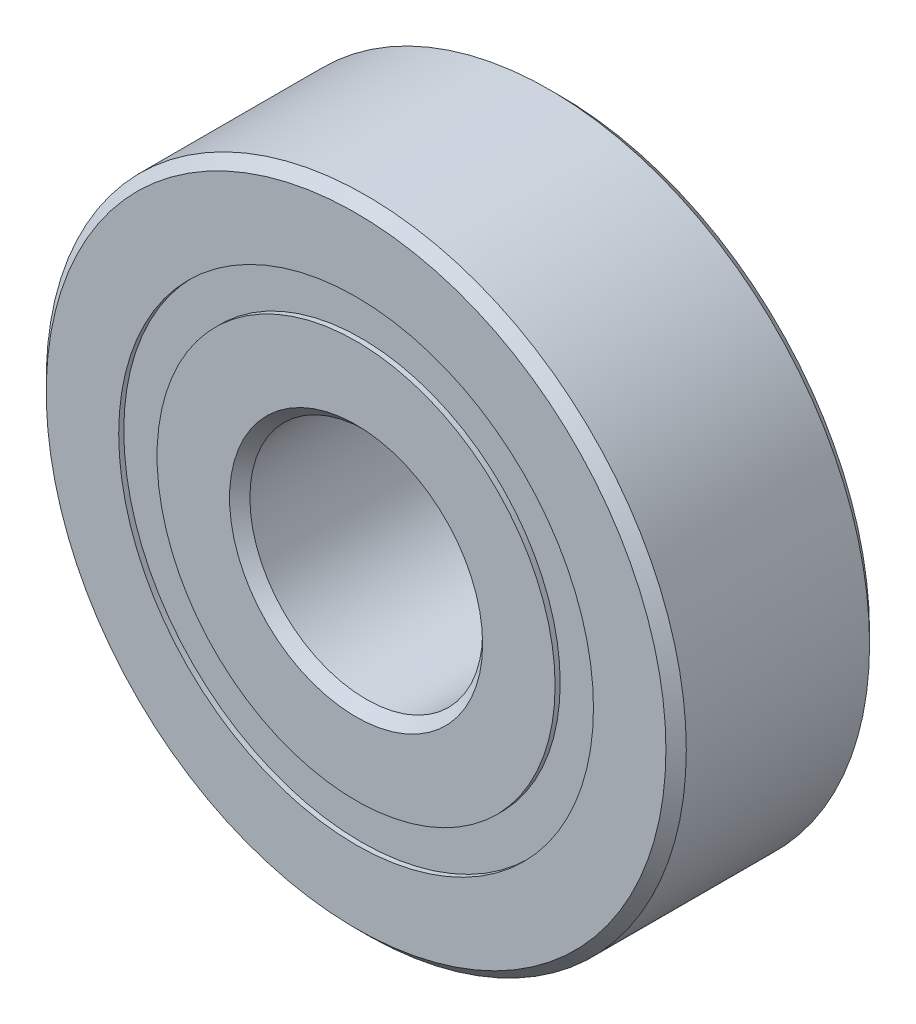
ISO-10303-21;
HEADER;
FILE_DESCRIPTION(('STEP AP214'),'2;1');
FILE_NAME('part.step','',(''),(''),'','','');
FILE_SCHEMA(('AUTOMOTIVE_DESIGN { 1 0 10303 214 1 1 1 1 }'));
ENDSEC;
DATA;
#1=APPLICATION_CONTEXT('core data for automotive mechanical design processes');
#2=APPLICATION_PROTOCOL_DEFINITION('international standard','automotive_design',2000,#1);
#3=PRODUCT_CONTEXT('',#1,'mechanical');
#4=PRODUCT('Part','Part','',(#3));
#5=PRODUCT_RELATED_PRODUCT_CATEGORY('part','',(#4));
#6=PRODUCT_DEFINITION_FORMATION('','',#4);
#7=PRODUCT_DEFINITION_CONTEXT('part definition',#1,'design');
#8=PRODUCT_DEFINITION('design','',#6,#7);
#9=PRODUCT_DEFINITION_SHAPE('','',#8);
#10=(LENGTH_UNIT() NAMED_UNIT(*) SI_UNIT(.MILLI.,.METRE.));
#11=(NAMED_UNIT(*) PLANE_ANGLE_UNIT() SI_UNIT($,.RADIAN.));
#12=(NAMED_UNIT(*) SI_UNIT($,.STERADIAN.) SOLID_ANGLE_UNIT());
#13=UNCERTAINTY_MEASURE_WITH_UNIT(LENGTH_MEASURE(1.E-05),#10,'distance_accuracy_value','');
#14=(GEOMETRIC_REPRESENTATION_CONTEXT(3) GLOBAL_UNCERTAINTY_ASSIGNED_CONTEXT((#13)) GLOBAL_UNIT_ASSIGNED_CONTEXT((#10,
#11,#12)) REPRESENTATION_CONTEXT('',''));
#15=CARTESIAN_POINT('',(0.,0.,0.));
#16=DIRECTION('',(0.,0.,1.));
#17=DIRECTION('',(1.,0.,0.));
#18=AXIS2_PLACEMENT_3D('',#15,#16,#17);
#19=CARTESIAN_POINT('',(0.,8.15934065934066,-3.325));
#20=DIRECTION('',(0.,0.,1.));
#21=DIRECTION('',(1.,0.,0.));
#22=AXIS2_PLACEMENT_3D('',#19,#20,#21);
#23=PLANE('',#22);
#24=CARTESIAN_POINT('',(0.,0.,-3.325));
#25=DIRECTION('',(0.,0.,1.));
#26=DIRECTION('',(1.,0.,0.));
#27=AXIS2_PLACEMENT_3D('',#24,#25,#26);
#28=CIRCLE('',#27,8.15934065934066);
#29=CARTESIAN_POINT('',(8.15934065934066,0.,-3.325));
#30=VERTEX_POINT('',#29);
#31=EDGE_CURVE('E55',#30,#30,#28,.T.);
#32=ORIENTED_EDGE('',*,*,#31,.F.);
#33=EDGE_LOOP('',(#32));
#34=FACE_BOUND('',#33,.T.);
#35=CARTESIAN_POINT('',(0.,0.,-3.325));
#36=DIRECTION('',(0.,0.,1.));
#37=DIRECTION('',(1.,0.,0.));
#38=AXIS2_PLACEMENT_3D('',#35,#36,#37);
#39=CIRCLE('',#38,6.84065934065934);
#40=CARTESIAN_POINT('',(6.84065934065934,0.,-3.325));
#41=VERTEX_POINT('',#40);
#42=EDGE_CURVE('E11',#41,#41,#39,.T.);
#43=ORIENTED_EDGE('',*,*,#42,.T.);
#44=EDGE_LOOP('',(#43));
#45=FACE_BOUND('',#44,.T.);
#46=ADVANCED_FACE('F41',(#34,#45),#23,.F.);
#47=CARTESIAN_POINT('',(0.,0.,3.5));
#48=DIRECTION('',(0.,0.,1.));
#49=DIRECTION('',(1.,0.,0.));
#50=AXIS2_PLACEMENT_3D('',#47,#48,#49);
#51=CYLINDRICAL_SURFACE('',#50,6.84065934065934);
#52=ORIENTED_EDGE('',*,*,#42,.F.);
#53=EDGE_LOOP('',(#52));
#54=FACE_BOUND('',#53,.T.);
#55=CARTESIAN_POINT('',(0.,0.,-1.68952158656808));
#56=DIRECTION('',(0.,0.,1.));
#57=DIRECTION('',(1.,0.,0.));
#58=AXIS2_PLACEMENT_3D('',#55,#56,#57);
#59=CIRCLE('',#58,6.84065934065934);
#60=CARTESIAN_POINT('',(6.84065934065934,0.,-1.68952158656808));
#61=VERTEX_POINT('',#60);
#62=EDGE_CURVE('E47',#61,#61,#59,.T.);
#63=ORIENTED_EDGE('',*,*,#62,.T.);
#64=EDGE_LOOP('',(#63));
#65=FACE_BOUND('',#64,.T.);
#66=ADVANCED_FACE('F64',(#54,#65),#51,.F.);
#67=CARTESIAN_POINT('',(0.,8.15934065934066,-1.68952158656808));
#68=DIRECTION('',(0.,0.,-1.));
#69=DIRECTION('',(-1.,0.,0.));
#70=AXIS2_PLACEMENT_3D('',#67,#68,#69);
#71=PLANE('',#70);
#72=ORIENTED_EDGE('',*,*,#62,.F.);
#73=EDGE_LOOP('',(#72));
#74=FACE_BOUND('',#73,.T.);
#75=CARTESIAN_POINT('',(0.,0.,-1.68952158656808));
#76=DIRECTION('',(0.,0.,1.));
#77=DIRECTION('',(1.,0.,0.));
#78=AXIS2_PLACEMENT_3D('',#75,#76,#77);
#79=CIRCLE('',#78,8.15934065934066);
#80=CARTESIAN_POINT('',(8.15934065934066,0.,-1.68952158656808));
#81=VERTEX_POINT('',#80);
#82=EDGE_CURVE('E51',#81,#81,#79,.T.);
#83=ORIENTED_EDGE('',*,*,#82,.T.);
#84=EDGE_LOOP('',(#83));
#85=FACE_BOUND('',#84,.T.);
#86=ADVANCED_FACE('F68',(#74,#85),#71,.F.);
#87=CARTESIAN_POINT('',(0.,0.,3.5));
#88=DIRECTION('',(0.,0.,1.));
#89=DIRECTION('',(1.,0.,0.));
#90=AXIS2_PLACEMENT_3D('',#87,#88,#89);
#91=CYLINDRICAL_SURFACE('',#90,8.15934065934066);
#92=ORIENTED_EDGE('',*,*,#82,.F.);
#93=EDGE_LOOP('',(#92));
#94=FACE_BOUND('',#93,.T.);
#95=ORIENTED_EDGE('',*,*,#31,.T.);
#96=EDGE_LOOP('',(#95));
#97=FACE_BOUND('',#96,.T.);
#98=ADVANCED_FACE('F61',(#94,#97),#91,.T.);
#99=CLOSED_SHELL('',(#46,#66,#86,#98));
#100=MANIFOLD_SOLID_BREP('B2',#99);
#101=CARTESIAN_POINT('',(0.,8.15934065934066,3.325));
#102=DIRECTION('',(0.,0.,-1.));
#103=DIRECTION('',(-1.,0.,0.));
#104=AXIS2_PLACEMENT_3D('',#101,#102,#103);
#105=PLANE('',#104);
#106=CARTESIAN_POINT('',(0.,0.,3.325));
#107=DIRECTION('',(0.,0.,1.));
#108=DIRECTION('',(1.,0.,0.));
#109=AXIS2_PLACEMENT_3D('',#106,#107,#108);
#110=CIRCLE('',#109,6.84065934065934);
#111=CARTESIAN_POINT('',(6.84065934065934,0.,3.325));
#112=VERTEX_POINT('',#111);
#113=EDGE_CURVE('E40',#112,#112,#110,.T.);
#114=ORIENTED_EDGE('',*,*,#113,.F.);
#115=EDGE_LOOP('',(#114));
#116=FACE_BOUND('',#115,.T.);
#117=CARTESIAN_POINT('',(0.,0.,3.325));
#118=DIRECTION('',(0.,0.,1.));
#119=DIRECTION('',(1.,0.,0.));
#120=AXIS2_PLACEMENT_3D('',#117,#118,#119);
#121=CIRCLE('',#120,8.15934065934066);
#122=CARTESIAN_POINT('',(8.15934065934066,0.,3.325));
#123=VERTEX_POINT('',#122);
#124=EDGE_CURVE('E122',#123,#123,#121,.T.);
#125=ORIENTED_EDGE('',*,*,#124,.T.);
#126=EDGE_LOOP('',(#125));
#127=FACE_BOUND('',#126,.T.);
#128=ADVANCED_FACE('F108',(#116,#127),#105,.F.);
#129=CARTESIAN_POINT('',(0.,0.,3.5));
#130=DIRECTION('',(0.,0.,1.));
#131=DIRECTION('',(1.,0.,0.));
#132=AXIS2_PLACEMENT_3D('',#129,#130,#131);
#133=CYLINDRICAL_SURFACE('',#132,6.84065934065934);
#134=CARTESIAN_POINT('',(0.,0.,1.68952158656808));
#135=DIRECTION('',(0.,0.,1.));
#136=DIRECTION('',(1.,0.,0.));
#137=AXIS2_PLACEMENT_3D('',#134,#135,#136);
#138=CIRCLE('',#137,6.84065934065934);
#139=CARTESIAN_POINT('',(6.84065934065934,0.,1.68952158656808));
#140=VERTEX_POINT('',#139);
#141=EDGE_CURVE('E114',#140,#140,#138,.T.);
#142=ORIENTED_EDGE('',*,*,#141,.F.);
#143=EDGE_LOOP('',(#142));
#144=FACE_BOUND('',#143,.T.);
#145=ORIENTED_EDGE('',*,*,#113,.T.);
#146=EDGE_LOOP('',(#145));
#147=FACE_BOUND('',#146,.T.);
#148=ADVANCED_FACE('F137',(#144,#147),#133,.F.);
#149=CARTESIAN_POINT('',(0.,8.15934065934066,1.68952158656808));
#150=DIRECTION('',(0.,0.,1.));
#151=DIRECTION('',(1.,0.,0.));
#152=AXIS2_PLACEMENT_3D('',#149,#150,#151);
#153=PLANE('',#152);
#154=CARTESIAN_POINT('',(0.,0.,1.68952158656808));
#155=DIRECTION('',(0.,0.,1.));
#156=DIRECTION('',(1.,0.,0.));
#157=AXIS2_PLACEMENT_3D('',#154,#155,#156);
#158=CIRCLE('',#157,8.15934065934066);
#159=CARTESIAN_POINT('',(8.15934065934066,0.,1.68952158656808));
#160=VERTEX_POINT('',#159);
#161=EDGE_CURVE('E118',#160,#160,#158,.T.);
#162=ORIENTED_EDGE('',*,*,#161,.F.);
#163=EDGE_LOOP('',(#162));
#164=FACE_BOUND('',#163,.T.);
#165=ORIENTED_EDGE('',*,*,#141,.T.);
#166=EDGE_LOOP('',(#165));
#167=FACE_BOUND('',#166,.T.);
#168=ADVANCED_FACE('F132',(#164,#167),#153,.F.);
#169=CARTESIAN_POINT('',(0.,0.,3.5));
#170=DIRECTION('',(0.,0.,1.));
#171=DIRECTION('',(1.,0.,0.));
#172=AXIS2_PLACEMENT_3D('',#169,#170,#171);
#173=CYLINDRICAL_SURFACE('',#172,8.15934065934066);
#174=ORIENTED_EDGE('',*,*,#124,.F.);
#175=EDGE_LOOP('',(#174));
#176=FACE_BOUND('',#175,.T.);
#177=ORIENTED_EDGE('',*,*,#161,.T.);
#178=EDGE_LOOP('',(#177));
#179=FACE_BOUND('',#178,.T.);
#180=ADVANCED_FACE('F129',(#176,#179),#173,.T.);
#181=CLOSED_SHELL('',(#128,#148,#168,#180));
#182=MANIFOLD_SOLID_BREP('B6',#181);
#183=CARTESIAN_POINT('',(-3.74999999999992,6.49519052838334,0.));
#184=DIRECTION('',(0.,0.,1.));
#185=DIRECTION('',(-0.499999999999989,0.866025403784445,0.));
#186=AXIS2_PLACEMENT_3D('',#183,#184,#185);
#187=SPHERICAL_SURFACE('',#186,1.68952158656808);
#188=CARTESIAN_POINT('',(-3.74999999999992,6.49519052838334,1.68952158656808));
#189=VERTEX_POINT('',#188);
#190=VERTEX_LOOP('',#189);
#191=FACE_BOUND('',#190,.T.);
#192=ADVANCED_FACE('F175',(#191),#187,.T.);
#193=CLOSED_SHELL('',(#192));
#194=MANIFOLD_SOLID_BREP('B35',#193);
#195=CARTESIAN_POINT('',(-6.49519052838325,3.75000000000008,0.));
#196=DIRECTION('',(0.,0.,1.));
#197=DIRECTION('',(-0.866025403784433,0.50000000000001,0.));
#198=AXIS2_PLACEMENT_3D('',#195,#196,#197);
#199=SPHERICAL_SURFACE('',#198,1.68952158656808);
#200=CARTESIAN_POINT('',(-6.49519052838325,3.75000000000008,1.68952158656808));
#201=VERTEX_POINT('',#200);
#202=VERTEX_LOOP('',#201);
#203=FACE_BOUND('',#202,.T.);
#204=ADVANCED_FACE('F195',(#203),#199,.T.);
#205=CLOSED_SHELL('',(#204));
#206=MANIFOLD_SOLID_BREP('B104',#205);
#207=CARTESIAN_POINT('',(-7.5,0.,0.));
#208=DIRECTION('',(0.,0.,1.));
#209=DIRECTION('',(-1.,0.,0.));
#210=AXIS2_PLACEMENT_3D('',#207,#208,#209);
#211=SPHERICAL_SURFACE('',#210,1.68952158656808);
#212=CARTESIAN_POINT('',(-7.5,0.,1.68952158656808));
#213=VERTEX_POINT('',#212);
#214=VERTEX_LOOP('',#213);
#215=FACE_BOUND('',#214,.T.);
#216=ADVANCED_FACE('F215',(#215),#211,.T.);
#217=CLOSED_SHELL('',(#216));
#218=MANIFOLD_SOLID_BREP('B171',#217);
#219=CARTESIAN_POINT('',(-6.49519052838332,-3.74999999999994,0.));
#220=DIRECTION('',(0.,0.,1.));
#221=DIRECTION('',(-0.866025403784443,-0.499999999999992,0.));
#222=AXIS2_PLACEMENT_3D('',#219,#220,#221);
#223=SPHERICAL_SURFACE('',#222,1.68952158656808);
#224=CARTESIAN_POINT('',(-6.49519052838332,-3.74999999999994,1.68952158656808));
#225=VERTEX_POINT('',#224);
#226=VERTEX_LOOP('',#225);
#227=FACE_BOUND('',#226,.T.);
#228=ADVANCED_FACE('F235',(#227),#223,.T.);
#229=CLOSED_SHELL('',(#228));
#230=MANIFOLD_SOLID_BREP('B191',#229);
#231=CARTESIAN_POINT('',(-3.75000000000005,-6.49519052838326,0.));
#232=DIRECTION('',(0.,0.,1.));
#233=DIRECTION('',(-0.500000000000007,-0.866025403784435,0.));
#234=AXIS2_PLACEMENT_3D('',#231,#232,#233);
#235=SPHERICAL_SURFACE('',#234,1.68952158656808);
#236=CARTESIAN_POINT('',(-3.75000000000005,-6.49519052838326,1.68952158656808));
#237=VERTEX_POINT('',#236);
#238=VERTEX_LOOP('',#237);
#239=FACE_BOUND('',#238,.T.);
#240=ADVANCED_FACE('F255',(#239),#235,.T.);
#241=CLOSED_SHELL('',(#240));
#242=MANIFOLD_SOLID_BREP('B211',#241);
#243=CARTESIAN_POINT('',(0.,-7.5,0.));
#244=DIRECTION('',(0.,0.,1.));
#245=DIRECTION('',(0.,-1.,0.));
#246=AXIS2_PLACEMENT_3D('',#243,#244,#245);
#247=SPHERICAL_SURFACE('',#246,1.68952158656808);
#248=CARTESIAN_POINT('',(0.,-7.5,1.68952158656808));
#249=VERTEX_POINT('',#248);
#250=VERTEX_LOOP('',#249);
#251=FACE_BOUND('',#250,.T.);
#252=ADVANCED_FACE('F275',(#251),#247,.T.);
#253=CLOSED_SHELL('',(#252));
#254=MANIFOLD_SOLID_BREP('B231',#253);
#255=CARTESIAN_POINT('',(3.74999999999996,-6.49519052838331,0.));
#256=DIRECTION('',(0.,0.,1.));
#257=DIRECTION('',(0.499999999999995,-0.866025403784442,0.));
#258=AXIS2_PLACEMENT_3D('',#255,#256,#257);
#259=SPHERICAL_SURFACE('',#258,1.68952158656808);
#260=CARTESIAN_POINT('',(3.74999999999996,-6.49519052838331,1.68952158656808));
#261=VERTEX_POINT('',#260);
#262=VERTEX_LOOP('',#261);
#263=FACE_BOUND('',#262,.T.);
#264=ADVANCED_FACE('F295',(#263),#259,.T.);
#265=CLOSED_SHELL('',(#264));
#266=MANIFOLD_SOLID_BREP('B251',#265);
#267=CARTESIAN_POINT('',(6.49519052838327,-3.75000000000003,0.));
#268=DIRECTION('',(0.,0.,1.));
#269=DIRECTION('',(0.866025403784436,-0.500000000000004,0.));
#270=AXIS2_PLACEMENT_3D('',#267,#268,#269);
#271=SPHERICAL_SURFACE('',#270,1.68952158656808);
#272=CARTESIAN_POINT('',(6.49519052838327,-3.75000000000003,1.68952158656808));
#273=VERTEX_POINT('',#272);
#274=VERTEX_LOOP('',#273);
#275=FACE_BOUND('',#274,.T.);
#276=ADVANCED_FACE('F315',(#275),#271,.T.);
#277=CLOSED_SHELL('',(#276));
#278=MANIFOLD_SOLID_BREP('B271',#277);
#279=CARTESIAN_POINT('',(7.5,0.,0.));
#280=DIRECTION('',(0.,0.,1.));
#281=DIRECTION('',(1.,0.,0.));
#282=AXIS2_PLACEMENT_3D('',#279,#280,#281);
#283=SPHERICAL_SURFACE('',#282,1.68952158656808);
#284=CARTESIAN_POINT('',(7.5,0.,1.68952158656808));
#285=VERTEX_POINT('',#284);
#286=VERTEX_LOOP('',#285);
#287=FACE_BOUND('',#286,.T.);
#288=ADVANCED_FACE('F335',(#287),#283,.T.);
#289=CLOSED_SHELL('',(#288));
#290=MANIFOLD_SOLID_BREP('B291',#289);
#291=CARTESIAN_POINT('',(6.4951905283833,3.74999999999998,0.));
#292=DIRECTION('',(0.,0.,1.));
#293=DIRECTION('',(0.86602540378444,0.499999999999998,0.));
#294=AXIS2_PLACEMENT_3D('',#291,#292,#293);
#295=SPHERICAL_SURFACE('',#294,1.68952158656808);
#296=CARTESIAN_POINT('',(6.4951905283833,3.74999999999998,1.68952158656808));
#297=VERTEX_POINT('',#296);
#298=VERTEX_LOOP('',#297);
#299=FACE_BOUND('',#298,.T.);
#300=ADVANCED_FACE('F355',(#299),#295,.T.);
#301=CLOSED_SHELL('',(#300));
#302=MANIFOLD_SOLID_BREP('B311',#301);
#303=CARTESIAN_POINT('',(3.75000000000001,6.49519052838328,0.));
#304=DIRECTION('',(0.,0.,1.));
#305=DIRECTION('',(0.500000000000001,0.866025403784438,0.));
#306=AXIS2_PLACEMENT_3D('',#303,#304,#305);
#307=SPHERICAL_SURFACE('',#306,1.68952158656808);
#308=CARTESIAN_POINT('',(3.75000000000001,6.49519052838328,1.68952158656808));
#309=VERTEX_POINT('',#308);
#310=VERTEX_LOOP('',#309);
#311=FACE_BOUND('',#310,.T.);
#312=ADVANCED_FACE('F375',(#311),#307,.T.);
#313=CLOSED_SHELL('',(#312));
#314=MANIFOLD_SOLID_BREP('B331',#313);
#315=CARTESIAN_POINT('',(0.,7.5,0.));
#316=DIRECTION('',(0.,0.,1.));
#317=DIRECTION('',(0.,1.,0.));
#318=AXIS2_PLACEMENT_3D('',#315,#316,#317);
#319=SPHERICAL_SURFACE('',#318,1.68952158656808);
#320=CARTESIAN_POINT('',(0.,7.5,1.68952158656808));
#321=VERTEX_POINT('',#320);
#322=VERTEX_LOOP('',#321);
#323=FACE_BOUND('',#322,.T.);
#324=ADVANCED_FACE('F397',(#323),#319,.T.);
#325=CLOSED_SHELL('',(#324));
#326=MANIFOLD_SOLID_BREP('B351',#325);
#327=CARTESIAN_POINT('',(0.,6.84065934065934,3.5));
#328=DIRECTION('',(0.,0.,-1.));
#329=DIRECTION('',(-1.,0.,0.));
#330=AXIS2_PLACEMENT_3D('',#327,#328,#329);
#331=PLANE('',#330);
#332=CARTESIAN_POINT('',(0.,0.,3.5));
#333=DIRECTION('',(0.,0.,1.));
#334=DIRECTION('',(1.,0.,0.));
#335=AXIS2_PLACEMENT_3D('',#332,#333,#334);
#336=CIRCLE('',#335,4.35);
#337=CARTESIAN_POINT('',(4.35,0.,3.5));
#338=VERTEX_POINT('',#337);
#339=EDGE_CURVE('E444',#338,#338,#336,.T.);
#340=ORIENTED_EDGE('',*,*,#339,.F.);
#341=EDGE_LOOP('',(#340));
#342=FACE_BOUND('',#341,.T.);
#343=CARTESIAN_POINT('',(0.,0.,3.5));
#344=DIRECTION('',(0.,0.,1.));
#345=DIRECTION('',(1.,0.,0.));
#346=AXIS2_PLACEMENT_3D('',#343,#344,#345);
#347=CIRCLE('',#346,6.84065934065934);
#348=CARTESIAN_POINT('',(6.84065934065934,0.,3.5));
#349=VERTEX_POINT('',#348);
#350=EDGE_CURVE('E396',#349,#349,#347,.T.);
#351=ORIENTED_EDGE('',*,*,#350,.T.);
#352=EDGE_LOOP('',(#351));
#353=FACE_BOUND('',#352,.T.);
#354=ADVANCED_FACE('F416',(#342,#353),#331,.F.);
#355=CARTESIAN_POINT('',(0.,0.,3.5));
#356=DIRECTION('',(0.,0.,1.));
#357=DIRECTION('',(1.,0.,0.));
#358=AXIS2_PLACEMENT_3D('',#355,#356,#357);
#359=CYLINDRICAL_SURFACE('',#358,6.84065934065934);
#360=ORIENTED_EDGE('',*,*,#350,.F.);
#361=EDGE_LOOP('',(#360));
#362=FACE_BOUND('',#361,.T.);
#363=CARTESIAN_POINT('',(0.,0.,1.55555555555556));
#364=DIRECTION('',(0.,0.,1.));
#365=DIRECTION('',(1.,0.,0.));
#366=AXIS2_PLACEMENT_3D('',#363,#364,#365);
#367=CIRCLE('',#366,6.84065934065934);
#368=CARTESIAN_POINT('',(6.84065934065934,0.,1.55555555555556));
#369=VERTEX_POINT('',#368);
#370=EDGE_CURVE('E422',#369,#369,#367,.T.);
#371=ORIENTED_EDGE('',*,*,#370,.T.);
#372=EDGE_LOOP('',(#371));
#373=FACE_BOUND('',#372,.T.);
#374=ADVANCED_FACE('F451',(#362,#373),#359,.T.);
#375=CARTESIAN_POINT('',(0.,0.,0.));
#376=DIRECTION('',(0.,0.,1.));
#377=DIRECTION('',(1.,0.,0.));
#378=AXIS2_PLACEMENT_3D('',#375,#376,#377);
#379=TOROIDAL_SURFACE('',#378,7.5,1.68952158656808);
#380=ORIENTED_EDGE('',*,*,#370,.F.);
#381=EDGE_LOOP('',(#380));
#382=FACE_BOUND('',#381,.T.);
#383=CARTESIAN_POINT('',(0.,0.,-1.55555555555556));
#384=DIRECTION('',(0.,0.,1.));
#385=DIRECTION('',(1.,0.,0.));
#386=AXIS2_PLACEMENT_3D('',#383,#384,#385);
#387=CIRCLE('',#386,6.84065934065934);
#388=CARTESIAN_POINT('',(6.84065934065934,0.,-1.55555555555556));
#389=VERTEX_POINT('',#388);
#390=EDGE_CURVE('E426',#389,#389,#387,.T.);
#391=ORIENTED_EDGE('',*,*,#390,.T.);
#392=EDGE_LOOP('',(#391));
#393=FACE_BOUND('',#392,.T.);
#394=ADVANCED_FACE('F455',(#382,#393),#379,.F.);
#395=CARTESIAN_POINT('',(0.,0.,3.5));
#396=DIRECTION('',(0.,0.,1.));
#397=DIRECTION('',(1.,0.,0.));
#398=AXIS2_PLACEMENT_3D('',#395,#396,#397);
#399=CYLINDRICAL_SURFACE('',#398,6.84065934065934);
#400=ORIENTED_EDGE('',*,*,#390,.F.);
#401=EDGE_LOOP('',(#400));
#402=FACE_BOUND('',#401,.T.);
#403=CARTESIAN_POINT('',(0.,0.,-3.5));
#404=DIRECTION('',(0.,0.,1.));
#405=DIRECTION('',(1.,0.,0.));
#406=AXIS2_PLACEMENT_3D('',#403,#404,#405);
#407=CIRCLE('',#406,6.84065934065934);
#408=CARTESIAN_POINT('',(6.84065934065934,0.,-3.5));
#409=VERTEX_POINT('',#408);
#410=EDGE_CURVE('E430',#409,#409,#407,.T.);
#411=ORIENTED_EDGE('',*,*,#410,.T.);
#412=EDGE_LOOP('',(#411));
#413=FACE_BOUND('',#412,.T.);
#414=ADVANCED_FACE('F460',(#402,#413),#399,.T.);
#415=CARTESIAN_POINT('',(0.,4.35,-3.5));
#416=DIRECTION('',(0.,0.,1.));
#417=DIRECTION('',(1.,0.,0.));
#418=AXIS2_PLACEMENT_3D('',#415,#416,#417);
#419=PLANE('',#418);
#420=ORIENTED_EDGE('',*,*,#410,.F.);
#421=EDGE_LOOP('',(#420));
#422=FACE_BOUND('',#421,.T.);
#423=CARTESIAN_POINT('',(0.,0.,-3.5));
#424=DIRECTION('',(0.,0.,1.));
#425=DIRECTION('',(1.,0.,0.));
#426=AXIS2_PLACEMENT_3D('',#423,#424,#425);
#427=CIRCLE('',#426,4.35);
#428=CARTESIAN_POINT('',(4.35,0.,-3.5));
#429=VERTEX_POINT('',#428);
#430=EDGE_CURVE('E435',#429,#429,#427,.T.);
#431=ORIENTED_EDGE('',*,*,#430,.T.);
#432=EDGE_LOOP('',(#431));
#433=FACE_BOUND('',#432,.T.);
#434=ADVANCED_FACE('F466',(#422,#433),#419,.F.);
#435=CARTESIAN_POINT('',(0.,0.,-3.15));
#436=DIRECTION('',(0.,0.,-1.));
#437=DIRECTION('',(-1.,0.,0.));
#438=AXIS2_PLACEMENT_3D('',#435,#436,#437);
#439=CONICAL_SURFACE('',#438,4.,0.78539816339745);
#440=ORIENTED_EDGE('',*,*,#430,.F.);
#441=EDGE_LOOP('',(#440));
#442=FACE_BOUND('',#441,.T.);
#443=CARTESIAN_POINT('',(0.,0.,-3.15));
#444=DIRECTION('',(0.,0.,1.));
#445=DIRECTION('',(1.,0.,0.));
#446=AXIS2_PLACEMENT_3D('',#443,#444,#445);
#447=CIRCLE('',#446,4.);
#448=CARTESIAN_POINT('',(4.,0.,-3.15));
#449=VERTEX_POINT('',#448);
#450=EDGE_CURVE('E438',#449,#449,#447,.T.);
#451=ORIENTED_EDGE('',*,*,#450,.T.);
#452=EDGE_LOOP('',(#451));
#453=FACE_BOUND('',#452,.T.);
#454=ADVANCED_FACE('F470',(#442,#453),#439,.F.);
#455=CARTESIAN_POINT('',(0.,0.,3.5));
#456=DIRECTION('',(0.,0.,1.));
#457=DIRECTION('',(1.,0.,0.));
#458=AXIS2_PLACEMENT_3D('',#455,#456,#457);
#459=CYLINDRICAL_SURFACE('',#458,4.);
#460=ORIENTED_EDGE('',*,*,#450,.F.);
#461=EDGE_LOOP('',(#460));
#462=FACE_BOUND('',#461,.T.);
#463=CARTESIAN_POINT('',(0.,0.,3.15));
#464=DIRECTION('',(0.,0.,1.));
#465=DIRECTION('',(1.,0.,0.));
#466=AXIS2_PLACEMENT_3D('',#463,#464,#465);
#467=CIRCLE('',#466,4.);
#468=CARTESIAN_POINT('',(4.,0.,3.15));
#469=VERTEX_POINT('',#468);
#470=EDGE_CURVE('E441',#469,#469,#467,.T.);
#471=ORIENTED_EDGE('',*,*,#470,.T.);
#472=EDGE_LOOP('',(#471));
#473=FACE_BOUND('',#472,.T.);
#474=ADVANCED_FACE('F474',(#462,#473),#459,.F.);
#475=CARTESIAN_POINT('',(0.,0.,3.5));
#476=DIRECTION('',(0.,0.,1.));
#477=DIRECTION('',(1.,0.,0.));
#478=AXIS2_PLACEMENT_3D('',#475,#476,#477);
#479=CONICAL_SURFACE('',#478,4.35,0.78539816339745);
#480=ORIENTED_EDGE('',*,*,#470,.F.);
#481=EDGE_LOOP('',(#480));
#482=FACE_BOUND('',#481,.T.);
#483=ORIENTED_EDGE('',*,*,#339,.T.);
#484=EDGE_LOOP('',(#483));
#485=FACE_BOUND('',#484,.T.);
#486=ADVANCED_FACE('F448',(#482,#485),#479,.F.);
#487=CLOSED_SHELL('',(#354,#374,#394,#414,#434,#454,#474,#486));
#488=MANIFOLD_SOLID_BREP('B371',#487);
#489=CARTESIAN_POINT('',(0.,0.,3.15));
#490=DIRECTION('',(0.,0.,-1.));
#491=DIRECTION('',(-1.,0.,0.));
#492=AXIS2_PLACEMENT_3D('',#489,#490,#491);
#493=CONICAL_SURFACE('',#492,11.,0.785398163397448);
#494=CARTESIAN_POINT('',(0.,0.,3.5));
#495=DIRECTION('',(0.,0.,1.));
#496=DIRECTION('',(1.,0.,0.));
#497=AXIS2_PLACEMENT_3D('',#494,#495,#496);
#498=CIRCLE('',#497,10.65);
#499=CARTESIAN_POINT('',(10.65,0.,3.5));
#500=VERTEX_POINT('',#499);
#501=EDGE_CURVE('E565',#500,#500,#498,.T.);
#502=ORIENTED_EDGE('',*,*,#501,.F.);
#503=EDGE_LOOP('',(#502));
#504=FACE_BOUND('',#503,.T.);
#505=CARTESIAN_POINT('',(0.,0.,3.15));
#506=DIRECTION('',(0.,0.,1.));
#507=DIRECTION('',(1.,0.,0.));
#508=AXIS2_PLACEMENT_3D('',#505,#506,#507);
#509=CIRCLE('',#508,11.);
#510=CARTESIAN_POINT('',(11.,0.,3.15));
#511=VERTEX_POINT('',#510);
#512=EDGE_CURVE('E415',#511,#511,#509,.T.);
#513=ORIENTED_EDGE('',*,*,#512,.T.);
#514=EDGE_LOOP('',(#513));
#515=FACE_BOUND('',#514,.T.);
#516=ADVANCED_FACE('F537',(#504,#515),#493,.T.);
#517=CARTESIAN_POINT('',(0.,0.,3.5));
#518=DIRECTION('',(0.,0.,1.));
#519=DIRECTION('',(1.,0.,0.));
#520=AXIS2_PLACEMENT_3D('',#517,#518,#519);
#521=CYLINDRICAL_SURFACE('',#520,11.);
#522=ORIENTED_EDGE('',*,*,#512,.F.);
#523=EDGE_LOOP('',(#522));
#524=FACE_BOUND('',#523,.T.);
#525=CARTESIAN_POINT('',(0.,0.,-3.15));
#526=DIRECTION('',(0.,0.,1.));
#527=DIRECTION('',(1.,0.,0.));
#528=AXIS2_PLACEMENT_3D('',#525,#526,#527);
#529=CIRCLE('',#528,11.);
#530=CARTESIAN_POINT('',(11.,0.,-3.15));
#531=VERTEX_POINT('',#530);
#532=EDGE_CURVE('E543',#531,#531,#529,.T.);
#533=ORIENTED_EDGE('',*,*,#532,.T.);
#534=EDGE_LOOP('',(#533));
#535=FACE_BOUND('',#534,.T.);
#536=ADVANCED_FACE('F572',(#524,#535),#521,.T.);
#537=CARTESIAN_POINT('',(0.,0.,-3.5));
#538=DIRECTION('',(0.,0.,1.));
#539=DIRECTION('',(1.,0.,0.));
#540=AXIS2_PLACEMENT_3D('',#537,#538,#539);
#541=CONICAL_SURFACE('',#540,10.65,0.785398163397448);
#542=ORIENTED_EDGE('',*,*,#532,.F.);
#543=EDGE_LOOP('',(#542));
#544=FACE_BOUND('',#543,.T.);
#545=CARTESIAN_POINT('',(0.,0.,-3.5));
#546=DIRECTION('',(0.,0.,1.));
#547=DIRECTION('',(1.,0.,0.));
#548=AXIS2_PLACEMENT_3D('',#545,#546,#547);
#549=CIRCLE('',#548,10.65);
#550=CARTESIAN_POINT('',(10.65,0.,-3.5));
#551=VERTEX_POINT('',#550);
#552=EDGE_CURVE('E547',#551,#551,#549,.T.);
#553=ORIENTED_EDGE('',*,*,#552,.T.);
#554=EDGE_LOOP('',(#553));
#555=FACE_BOUND('',#554,.T.);
#556=ADVANCED_FACE('F576',(#544,#555),#541,.T.);
#557=CARTESIAN_POINT('',(0.,10.65,-3.5));
#558=DIRECTION('',(0.,0.,1.));
#559=DIRECTION('',(1.,0.,0.));
#560=AXIS2_PLACEMENT_3D('',#557,#558,#559);
#561=PLANE('',#560);
#562=ORIENTED_EDGE('',*,*,#552,.F.);
#563=EDGE_LOOP('',(#562));
#564=FACE_BOUND('',#563,.T.);
#565=CARTESIAN_POINT('',(0.,0.,-3.5));
#566=DIRECTION('',(0.,0.,1.));
#567=DIRECTION('',(1.,0.,0.));
#568=AXIS2_PLACEMENT_3D('',#565,#566,#567);
#569=CIRCLE('',#568,8.15934065934066);
#570=CARTESIAN_POINT('',(8.15934065934066,0.,-3.5));
#571=VERTEX_POINT('',#570);
#572=EDGE_CURVE('E551',#571,#571,#569,.T.);
#573=ORIENTED_EDGE('',*,*,#572,.T.);
#574=EDGE_LOOP('',(#573));
#575=FACE_BOUND('',#574,.T.);
#576=ADVANCED_FACE('F581',(#564,#575),#561,.F.);
#577=CARTESIAN_POINT('',(0.,0.,3.5));
#578=DIRECTION('',(0.,0.,1.));
#579=DIRECTION('',(1.,0.,0.));
#580=AXIS2_PLACEMENT_3D('',#577,#578,#579);
#581=CYLINDRICAL_SURFACE('',#580,8.15934065934066);
#582=ORIENTED_EDGE('',*,*,#572,.F.);
#583=EDGE_LOOP('',(#582));
#584=FACE_BOUND('',#583,.T.);
#585=CARTESIAN_POINT('',(0.,0.,-1.55555555555556));
#586=DIRECTION('',(0.,0.,1.));
#587=DIRECTION('',(1.,0.,0.));
#588=AXIS2_PLACEMENT_3D('',#585,#586,#587);
#589=CIRCLE('',#588,8.15934065934066);
#590=CARTESIAN_POINT('',(8.15934065934066,0.,-1.55555555555556));
#591=VERTEX_POINT('',#590);
#592=EDGE_CURVE('E556',#591,#591,#589,.T.);
#593=ORIENTED_EDGE('',*,*,#592,.T.);
#594=EDGE_LOOP('',(#593));
#595=FACE_BOUND('',#594,.T.);
#596=ADVANCED_FACE('F587',(#584,#595),#581,.F.);
#597=CARTESIAN_POINT('',(0.,0.,0.));
#598=DIRECTION('',(0.,0.,1.));
#599=DIRECTION('',(1.,0.,0.));
#600=AXIS2_PLACEMENT_3D('',#597,#598,#599);
#601=TOROIDAL_SURFACE('',#600,7.5,1.68952158656808);
#602=ORIENTED_EDGE('',*,*,#592,.F.);
#603=EDGE_LOOP('',(#602));
#604=FACE_BOUND('',#603,.T.);
#605=CARTESIAN_POINT('',(0.,0.,1.55555555555556));
#606=DIRECTION('',(0.,0.,1.));
#607=DIRECTION('',(1.,0.,0.));
#608=AXIS2_PLACEMENT_3D('',#605,#606,#607);
#609=CIRCLE('',#608,8.15934065934066);
#610=CARTESIAN_POINT('',(8.15934065934066,0.,1.55555555555556));
#611=VERTEX_POINT('',#610);
#612=EDGE_CURVE('E559',#611,#611,#609,.T.);
#613=ORIENTED_EDGE('',*,*,#612,.T.);
#614=EDGE_LOOP('',(#613));
#615=FACE_BOUND('',#614,.T.);
#616=ADVANCED_FACE('F591',(#604,#615),#601,.F.);
#617=CARTESIAN_POINT('',(0.,0.,3.5));
#618=DIRECTION('',(0.,0.,1.));
#619=DIRECTION('',(1.,0.,0.));
#620=AXIS2_PLACEMENT_3D('',#617,#618,#619);
#621=CYLINDRICAL_SURFACE('',#620,8.15934065934066);
#622=ORIENTED_EDGE('',*,*,#612,.F.);
#623=EDGE_LOOP('',(#622));
#624=FACE_BOUND('',#623,.T.);
#625=CARTESIAN_POINT('',(0.,0.,3.5));
#626=DIRECTION('',(0.,0.,1.));
#627=DIRECTION('',(1.,0.,0.));
#628=AXIS2_PLACEMENT_3D('',#625,#626,#627);
#629=CIRCLE('',#628,8.15934065934066);
#630=CARTESIAN_POINT('',(8.15934065934066,0.,3.5));
#631=VERTEX_POINT('',#630);
#632=EDGE_CURVE('E562',#631,#631,#629,.T.);
#633=ORIENTED_EDGE('',*,*,#632,.T.);
#634=EDGE_LOOP('',(#633));
#635=FACE_BOUND('',#634,.T.);
#636=ADVANCED_FACE('F595',(#624,#635),#621,.F.);
#637=CARTESIAN_POINT('',(0.,10.65,3.5));
#638=DIRECTION('',(0.,0.,-1.));
#639=DIRECTION('',(-1.,0.,0.));
#640=AXIS2_PLACEMENT_3D('',#637,#638,#639);
#641=PLANE('',#640);
#642=ORIENTED_EDGE('',*,*,#632,.F.);
#643=EDGE_LOOP('',(#642));
#644=FACE_BOUND('',#643,.T.);
#645=ORIENTED_EDGE('',*,*,#501,.T.);
#646=EDGE_LOOP('',(#645));
#647=FACE_BOUND('',#646,.T.);
#648=ADVANCED_FACE('F569',(#644,#647),#641,.F.);
#649=CLOSED_SHELL('',(#516,#536,#556,#576,#596,#616,#636,#648));
#650=MANIFOLD_SOLID_BREP('B391',#649);
#651=ADVANCED_BREP_SHAPE_REPRESENTATION('',(#18,#100,#182,#194,#206,#218,#230,#242,#254,#266,
#278,#290,#302,#314,#326,#488,#650),#14);
#652=SHAPE_DEFINITION_REPRESENTATION(#9,#651);
ENDSEC;
END-ISO-10303-21;
